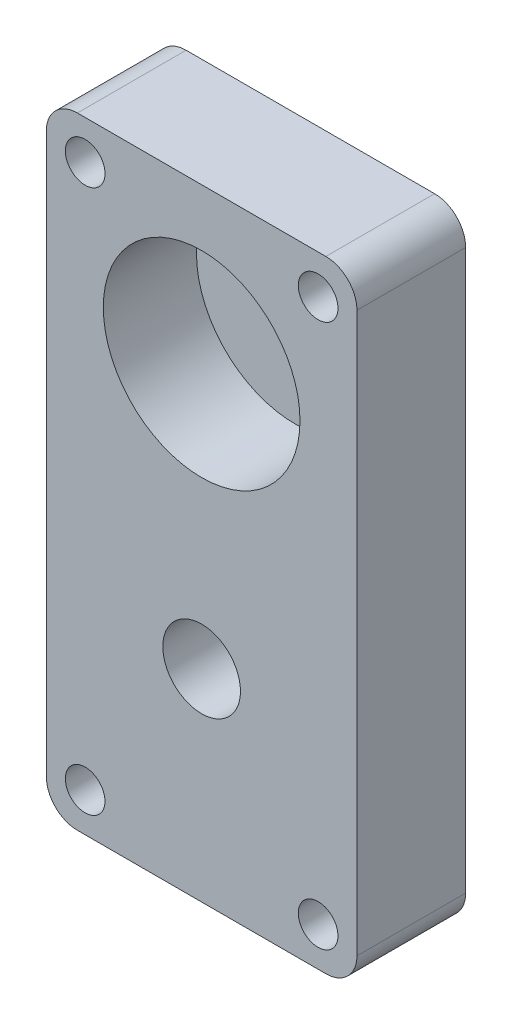
ISO-10303-21;
HEADER;
FILE_DESCRIPTION(('STEP AP214'),'2;1');
FILE_NAME('part.step','',(''),(''),'','','');
FILE_SCHEMA(('AUTOMOTIVE_DESIGN { 1 0 10303 214 1 1 1 1 }'));
ENDSEC;
DATA;
#1=APPLICATION_CONTEXT('core data for automotive mechanical design processes');
#2=APPLICATION_PROTOCOL_DEFINITION('international standard','automotive_design',2000,#1);
#3=PRODUCT_CONTEXT('',#1,'mechanical');
#4=PRODUCT('Part','Part','',(#3));
#5=PRODUCT_RELATED_PRODUCT_CATEGORY('part','',(#4));
#6=PRODUCT_DEFINITION_FORMATION('','',#4);
#7=PRODUCT_DEFINITION_CONTEXT('part definition',#1,'design');
#8=PRODUCT_DEFINITION('design','',#6,#7);
#9=PRODUCT_DEFINITION_SHAPE('','',#8);
#10=(LENGTH_UNIT() NAMED_UNIT(*) SI_UNIT(.MILLI.,.METRE.));
#11=(NAMED_UNIT(*) PLANE_ANGLE_UNIT() SI_UNIT($,.RADIAN.));
#12=(NAMED_UNIT(*) SI_UNIT($,.STERADIAN.) SOLID_ANGLE_UNIT());
#13=UNCERTAINTY_MEASURE_WITH_UNIT(LENGTH_MEASURE(1.E-05),#10,'distance_accuracy_value','');
#14=(GEOMETRIC_REPRESENTATION_CONTEXT(3) GLOBAL_UNCERTAINTY_ASSIGNED_CONTEXT((#13)) GLOBAL_UNIT_ASSIGNED_CONTEXT((#10,
#11,#12)) REPRESENTATION_CONTEXT('',''));
#15=CARTESIAN_POINT('',(0.,0.,0.));
#16=DIRECTION('',(0.,0.,1.));
#17=DIRECTION('',(1.,0.,0.));
#18=AXIS2_PLACEMENT_3D('',#15,#16,#17);
#19=CARTESIAN_POINT('',(0.,-34.,14.));
#20=DIRECTION('',(0.,0.,-1.));
#21=DIRECTION('',(-1.,0.,0.));
#22=AXIS2_PLACEMENT_3D('',#19,#20,#21);
#23=CYLINDRICAL_SURFACE('',#22,5.);
#24=CARTESIAN_POINT('',(0.,-34.,14.));
#25=DIRECTION('',(0.,0.,1.));
#26=DIRECTION('',(1.,0.,0.));
#27=AXIS2_PLACEMENT_3D('',#24,#25,#26);
#28=CIRCLE('',#27,5.);
#29=CARTESIAN_POINT('',(5.,-34.,14.));
#30=VERTEX_POINT('',#29);
#31=EDGE_CURVE('E208',#30,#30,#28,.T.);
#32=ORIENTED_EDGE('',*,*,#31,.T.);
#33=EDGE_LOOP('',(#32));
#34=FACE_BOUND('',#33,.T.);
#35=CARTESIAN_POINT('',(0.,-34.,2.));
#36=DIRECTION('',(0.,0.,-1.));
#37=DIRECTION('',(-1.,0.,0.));
#38=AXIS2_PLACEMENT_3D('',#35,#36,#37);
#39=CIRCLE('',#38,5.);
#40=CARTESIAN_POINT('',(-5.,-34.,2.));
#41=VERTEX_POINT('',#40);
#42=EDGE_CURVE('E39',#41,#41,#39,.T.);
#43=ORIENTED_EDGE('',*,*,#42,.T.);
#44=EDGE_LOOP('',(#43));
#45=FACE_BOUND('',#44,.T.);
#46=ADVANCED_FACE('F35',(#34,#45),#23,.F.);
#47=CARTESIAN_POINT('',(0.,0.,14.));
#48=DIRECTION('',(0.,0.,-1.));
#49=DIRECTION('',(-1.,0.,0.));
#50=AXIS2_PLACEMENT_3D('',#47,#48,#49);
#51=CYLINDRICAL_SURFACE('',#50,12.665);
#52=CARTESIAN_POINT('',(0.,0.,14.));
#53=DIRECTION('',(0.,0.,1.));
#54=DIRECTION('',(1.,0.,0.));
#55=AXIS2_PLACEMENT_3D('',#52,#53,#54);
#56=CIRCLE('',#55,12.665);
#57=CARTESIAN_POINT('',(12.665,0.,14.));
#58=VERTEX_POINT('',#57);
#59=EDGE_CURVE('E188',#58,#58,#56,.T.);
#60=ORIENTED_EDGE('',*,*,#59,.T.);
#61=EDGE_LOOP('',(#60));
#62=FACE_BOUND('',#61,.T.);
#63=CARTESIAN_POINT('',(0.,0.,2.));
#64=DIRECTION('',(0.,0.,-1.));
#65=DIRECTION('',(-1.,0.,0.));
#66=AXIS2_PLACEMENT_3D('',#63,#64,#65);
#67=CIRCLE('',#66,12.665);
#68=CARTESIAN_POINT('',(-12.665,0.,2.));
#69=VERTEX_POINT('',#68);
#70=EDGE_CURVE('E213',#69,#69,#67,.T.);
#71=ORIENTED_EDGE('',*,*,#70,.T.);
#72=EDGE_LOOP('',(#71));
#73=FACE_BOUND('',#72,.T.);
#74=ADVANCED_FACE('F231',(#62,#73),#51,.F.);
#75=CARTESIAN_POINT('',(0.,0.,14.));
#76=DIRECTION('',(0.,0.,1.));
#77=DIRECTION('',(1.,0.,0.));
#78=AXIS2_PLACEMENT_3D('',#75,#76,#77);
#79=PLANE('',#78);
#80=CARTESIAN_POINT('',(15.,-55.,14.));
#81=DIRECTION('',(0.,0.,1.));
#82=DIRECTION('',(-1.,0.,0.));
#83=AXIS2_PLACEMENT_3D('',#80,#81,#82);
#84=CIRCLE('',#83,2.55459899986939);
#85=CARTESIAN_POINT('',(12.4454010001306,-55.,14.));
#86=VERTEX_POINT('',#85);
#87=EDGE_CURVE('E202',#86,#86,#84,.T.);
#88=ORIENTED_EDGE('',*,*,#87,.F.);
#89=EDGE_LOOP('',(#88));
#90=FACE_BOUND('',#89,.T.);
#91=CARTESIAN_POINT('',(-15.,-55.,14.));
#92=DIRECTION('',(0.,0.,1.));
#93=DIRECTION('',(-1.,0.,0.));
#94=AXIS2_PLACEMENT_3D('',#91,#92,#93);
#95=CIRCLE('',#94,2.55459899986931);
#96=CARTESIAN_POINT('',(-17.5545989998693,-55.,14.));
#97=VERTEX_POINT('',#96);
#98=EDGE_CURVE('E192',#97,#97,#95,.T.);
#99=ORIENTED_EDGE('',*,*,#98,.F.);
#100=EDGE_LOOP('',(#99));
#101=FACE_BOUND('',#100,.T.);
#102=CARTESIAN_POINT('',(-15.,15.,14.));
#103=DIRECTION('',(0.,0.,1.));
#104=DIRECTION('',(1.,0.,0.));
#105=AXIS2_PLACEMENT_3D('',#102,#103,#104);
#106=CIRCLE('',#105,2.55459899986932);
#107=CARTESIAN_POINT('',(-12.4454010001307,15.,14.));
#108=VERTEX_POINT('',#107);
#109=EDGE_CURVE('E179',#108,#108,#106,.T.);
#110=ORIENTED_EDGE('',*,*,#109,.F.);
#111=EDGE_LOOP('',(#110));
#112=FACE_BOUND('',#111,.T.);
#113=DIRECTION('',(1.,0.,0.));
#114=VECTOR('',#113,1.);
#115=CARTESIAN_POINT('',(-20.,-60.,14.));
#116=LINE('',#115,#114);
#117=CARTESIAN_POINT('',(-16.,-60.,14.));
#118=VERTEX_POINT('',#117);
#119=CARTESIAN_POINT('',(16.,-60.,14.));
#120=VERTEX_POINT('',#119);
#121=EDGE_CURVE('E173',#118,#120,#116,.T.);
#122=ORIENTED_EDGE('',*,*,#121,.T.);
#123=CARTESIAN_POINT('',(16.,-56.,14.));
#124=DIRECTION('',(0.,0.,1.));
#125=DIRECTION('',(1.,0.,0.));
#126=AXIS2_PLACEMENT_3D('',#123,#124,#125);
#127=CIRCLE('',#126,4.);
#128=CARTESIAN_POINT('',(20.,-56.,14.));
#129=VERTEX_POINT('',#128);
#130=EDGE_CURVE('E151',#120,#129,#127,.T.);
#131=ORIENTED_EDGE('',*,*,#130,.T.);
#132=DIRECTION('',(0.,1.,0.));
#133=VECTOR('',#132,1.);
#134=CARTESIAN_POINT('',(20.,-10.,14.));
#135=LINE('',#134,#133);
#136=CARTESIAN_POINT('',(20.,16.,14.));
#137=VERTEX_POINT('',#136);
#138=EDGE_CURVE('E121',#129,#137,#135,.T.);
#139=ORIENTED_EDGE('',*,*,#138,.T.);
#140=CARTESIAN_POINT('',(16.,16.,14.));
#141=DIRECTION('',(0.,0.,1.));
#142=DIRECTION('',(1.,0.,0.));
#143=AXIS2_PLACEMENT_3D('',#140,#141,#142);
#144=CIRCLE('',#143,4.);
#145=CARTESIAN_POINT('',(16.,20.,14.));
#146=VERTEX_POINT('',#145);
#147=EDGE_CURVE('E57',#137,#146,#144,.T.);
#148=ORIENTED_EDGE('',*,*,#147,.T.);
#149=DIRECTION('',(-1.,0.,0.));
#150=VECTOR('',#149,1.);
#151=CARTESIAN_POINT('',(20.,20.,14.));
#152=LINE('',#151,#150);
#153=CARTESIAN_POINT('',(-16.,20.,14.));
#154=VERTEX_POINT('',#153);
#155=EDGE_CURVE('E138',#146,#154,#152,.T.);
#156=ORIENTED_EDGE('',*,*,#155,.T.);
#157=CARTESIAN_POINT('',(-16.,16.,14.));
#158=DIRECTION('',(0.,0.,1.));
#159=DIRECTION('',(1.,0.,0.));
#160=AXIS2_PLACEMENT_3D('',#157,#158,#159);
#161=CIRCLE('',#160,4.);
#162=CARTESIAN_POINT('',(-20.,16.,14.));
#163=VERTEX_POINT('',#162);
#164=EDGE_CURVE('E146',#154,#163,#161,.T.);
#165=ORIENTED_EDGE('',*,*,#164,.T.);
#166=DIRECTION('',(0.,-1.,0.));
#167=VECTOR('',#166,1.);
#168=CARTESIAN_POINT('',(-20.,-9.99999999999999,14.));
#169=LINE('',#168,#167);
#170=CARTESIAN_POINT('',(-20.,-56.,14.));
#171=VERTEX_POINT('',#170);
#172=EDGE_CURVE('E132',#163,#171,#169,.T.);
#173=ORIENTED_EDGE('',*,*,#172,.T.);
#174=CARTESIAN_POINT('',(-16.,-56.,14.));
#175=DIRECTION('',(0.,0.,1.));
#176=DIRECTION('',(1.,0.,0.));
#177=AXIS2_PLACEMENT_3D('',#174,#175,#176);
#178=CIRCLE('',#177,4.);
#179=EDGE_CURVE('E149',#171,#118,#178,.T.);
#180=ORIENTED_EDGE('',*,*,#179,.T.);
#181=EDGE_LOOP('',(#122,#131,#139,#148,#156,#165,#173,#180));
#182=FACE_BOUND('',#181,.T.);
#183=ORIENTED_EDGE('',*,*,#59,.F.);
#184=EDGE_LOOP('',(#183));
#185=FACE_BOUND('',#184,.T.);
#186=CARTESIAN_POINT('',(15.,15.,14.));
#187=DIRECTION('',(0.,0.,1.));
#188=DIRECTION('',(1.,0.,0.));
#189=AXIS2_PLACEMENT_3D('',#186,#187,#188);
#190=CIRCLE('',#189,2.55459899986937);
#191=CARTESIAN_POINT('',(17.5545989998694,15.,14.));
#192=VERTEX_POINT('',#191);
#193=EDGE_CURVE('E196',#192,#192,#190,.T.);
#194=ORIENTED_EDGE('',*,*,#193,.F.);
#195=EDGE_LOOP('',(#194));
#196=FACE_BOUND('',#195,.T.);
#197=ORIENTED_EDGE('',*,*,#31,.F.);
#198=EDGE_LOOP('',(#197));
#199=FACE_BOUND('',#198,.T.);
#200=ADVANCED_FACE('F169',(#90,#101,#112,#182,#185,#196,#199),#79,.T.);
#201=CARTESIAN_POINT('',(0.,0.,0.));
#202=DIRECTION('',(0.,0.,1.));
#203=DIRECTION('',(1.,0.,0.));
#204=AXIS2_PLACEMENT_3D('',#201,#202,#203);
#205=PLANE('',#204);
#206=DIRECTION('',(0.,1.,0.));
#207=VECTOR('',#206,1.);
#208=CARTESIAN_POINT('',(20.,-10.,0.));
#209=LINE('',#208,#207);
#210=CARTESIAN_POINT('',(20.,-56.,0.));
#211=VERTEX_POINT('',#210);
#212=CARTESIAN_POINT('',(20.,16.,0.));
#213=VERTEX_POINT('',#212);
#214=EDGE_CURVE('E119',#211,#213,#209,.T.);
#215=ORIENTED_EDGE('',*,*,#214,.F.);
#216=CARTESIAN_POINT('',(16.,-56.,0.));
#217=DIRECTION('',(0.,0.,1.));
#218=DIRECTION('',(1.,0.,0.));
#219=AXIS2_PLACEMENT_3D('',#216,#217,#218);
#220=CIRCLE('',#219,4.);
#221=CARTESIAN_POINT('',(16.,-60.,0.));
#222=VERTEX_POINT('',#221);
#223=EDGE_CURVE('E102',#211,#222,#220,.F.);
#224=ORIENTED_EDGE('',*,*,#223,.T.);
#225=DIRECTION('',(1.,0.,0.));
#226=VECTOR('',#225,1.);
#227=CARTESIAN_POINT('',(-20.,-60.,0.));
#228=LINE('',#227,#226);
#229=CARTESIAN_POINT('',(-16.,-60.,0.));
#230=VERTEX_POINT('',#229);
#231=EDGE_CURVE('E130',#230,#222,#228,.T.);
#232=ORIENTED_EDGE('',*,*,#231,.F.);
#233=CARTESIAN_POINT('',(-16.,-56.,0.));
#234=DIRECTION('',(0.,0.,1.));
#235=DIRECTION('',(1.,0.,0.));
#236=AXIS2_PLACEMENT_3D('',#233,#234,#235);
#237=CIRCLE('',#236,4.);
#238=CARTESIAN_POINT('',(-20.,-56.,0.));
#239=VERTEX_POINT('',#238);
#240=EDGE_CURVE('E113',#230,#239,#237,.F.);
#241=ORIENTED_EDGE('',*,*,#240,.T.);
#242=DIRECTION('',(0.,-1.,0.));
#243=VECTOR('',#242,1.);
#244=CARTESIAN_POINT('',(-20.,-9.99999999999999,0.));
#245=LINE('',#244,#243);
#246=CARTESIAN_POINT('',(-20.,16.,0.));
#247=VERTEX_POINT('',#246);
#248=EDGE_CURVE('E134',#247,#239,#245,.T.);
#249=ORIENTED_EDGE('',*,*,#248,.F.);
#250=CARTESIAN_POINT('',(-16.,16.,0.));
#251=DIRECTION('',(0.,0.,1.));
#252=DIRECTION('',(1.,0.,0.));
#253=AXIS2_PLACEMENT_3D('',#250,#251,#252);
#254=CIRCLE('',#253,4.);
#255=CARTESIAN_POINT('',(-16.,20.,0.));
#256=VERTEX_POINT('',#255);
#257=EDGE_CURVE('E122',#247,#256,#254,.F.);
#258=ORIENTED_EDGE('',*,*,#257,.T.);
#259=DIRECTION('',(-1.,0.,0.));
#260=VECTOR('',#259,1.);
#261=CARTESIAN_POINT('',(20.,20.,0.));
#262=LINE('',#261,#260);
#263=CARTESIAN_POINT('',(16.,20.,0.));
#264=VERTEX_POINT('',#263);
#265=EDGE_CURVE('E129',#264,#256,#262,.T.);
#266=ORIENTED_EDGE('',*,*,#265,.F.);
#267=CARTESIAN_POINT('',(16.,16.,0.));
#268=DIRECTION('',(0.,0.,1.));
#269=DIRECTION('',(1.,0.,0.));
#270=AXIS2_PLACEMENT_3D('',#267,#268,#269);
#271=CIRCLE('',#270,4.);
#272=EDGE_CURVE('E128',#264,#213,#271,.F.);
#273=ORIENTED_EDGE('',*,*,#272,.T.);
#274=EDGE_LOOP('',(#215,#224,#232,#241,#249,#258,#266,#273));
#275=FACE_BOUND('',#274,.T.);
#276=CARTESIAN_POINT('',(-15.,15.,0.));
#277=DIRECTION('',(0.,0.,1.));
#278=DIRECTION('',(1.,0.,0.));
#279=AXIS2_PLACEMENT_3D('',#276,#277,#278);
#280=CIRCLE('',#279,2.55459899986932);
#281=CARTESIAN_POINT('',(-12.4454010001307,15.,0.));
#282=VERTEX_POINT('',#281);
#283=EDGE_CURVE('E181',#282,#282,#280,.T.);
#284=ORIENTED_EDGE('',*,*,#283,.T.);
#285=EDGE_LOOP('',(#284));
#286=FACE_BOUND('',#285,.T.);
#287=CARTESIAN_POINT('',(-15.,-55.,0.));
#288=DIRECTION('',(0.,0.,1.));
#289=DIRECTION('',(-1.,0.,0.));
#290=AXIS2_PLACEMENT_3D('',#287,#288,#289);
#291=CIRCLE('',#290,2.55459899986931);
#292=CARTESIAN_POINT('',(-17.5545989998693,-55.,0.));
#293=VERTEX_POINT('',#292);
#294=EDGE_CURVE('E193',#293,#293,#291,.T.);
#295=ORIENTED_EDGE('',*,*,#294,.T.);
#296=EDGE_LOOP('',(#295));
#297=FACE_BOUND('',#296,.T.);
#298=CARTESIAN_POINT('',(15.,15.,0.));
#299=DIRECTION('',(0.,0.,1.));
#300=DIRECTION('',(1.,0.,0.));
#301=AXIS2_PLACEMENT_3D('',#298,#299,#300);
#302=CIRCLE('',#301,2.55459899986937);
#303=CARTESIAN_POINT('',(17.5545989998694,15.,0.));
#304=VERTEX_POINT('',#303);
#305=EDGE_CURVE('E199',#304,#304,#302,.T.);
#306=ORIENTED_EDGE('',*,*,#305,.T.);
#307=EDGE_LOOP('',(#306));
#308=FACE_BOUND('',#307,.T.);
#309=CARTESIAN_POINT('',(15.,-55.,0.));
#310=DIRECTION('',(0.,0.,1.));
#311=DIRECTION('',(-1.,0.,0.));
#312=AXIS2_PLACEMENT_3D('',#309,#310,#311);
#313=CIRCLE('',#312,2.55459899986939);
#314=CARTESIAN_POINT('',(12.4454010001306,-55.,0.));
#315=VERTEX_POINT('',#314);
#316=EDGE_CURVE('E205',#315,#315,#313,.T.);
#317=ORIENTED_EDGE('',*,*,#316,.T.);
#318=EDGE_LOOP('',(#317));
#319=FACE_BOUND('',#318,.T.);
#320=ADVANCED_FACE('F125',(#275,#286,#297,#308,#319),#205,.F.);
#321=CARTESIAN_POINT('',(-20.,-9.99999999999999,14.));
#322=DIRECTION('',(1.,0.,0.));
#323=DIRECTION('',(0.,1.,0.));
#324=AXIS2_PLACEMENT_3D('',#321,#322,#323);
#325=PLANE('',#324);
#326=ORIENTED_EDGE('',*,*,#248,.T.);
#327=DIRECTION('',(0.,0.,-1.));
#328=VECTOR('',#327,1.);
#329=CARTESIAN_POINT('',(-20.,-56.,14.));
#330=LINE('',#329,#328);
#331=EDGE_CURVE('E156',#239,#171,#330,.F.);
#332=ORIENTED_EDGE('',*,*,#331,.T.);
#333=ORIENTED_EDGE('',*,*,#172,.F.);
#334=DIRECTION('',(0.,0.,-1.));
#335=VECTOR('',#334,1.);
#336=CARTESIAN_POINT('',(-20.,16.,14.));
#337=LINE('',#336,#335);
#338=EDGE_CURVE('E153',#163,#247,#337,.T.);
#339=ORIENTED_EDGE('',*,*,#338,.T.);
#340=EDGE_LOOP('',(#326,#332,#333,#339));
#341=FACE_BOUND('',#340,.T.);
#342=ADVANCED_FACE('F163',(#341),#325,.F.);
#343=CARTESIAN_POINT('',(-20.,-60.,14.));
#344=DIRECTION('',(0.,1.,0.));
#345=DIRECTION('',(0.,0.,1.));
#346=AXIS2_PLACEMENT_3D('',#343,#344,#345);
#347=PLANE('',#346);
#348=ORIENTED_EDGE('',*,*,#231,.T.);
#349=DIRECTION('',(0.,0.,-1.));
#350=VECTOR('',#349,1.);
#351=CARTESIAN_POINT('',(16.,-60.,14.));
#352=LINE('',#351,#350);
#353=EDGE_CURVE('E107',#222,#120,#352,.F.);
#354=ORIENTED_EDGE('',*,*,#353,.T.);
#355=ORIENTED_EDGE('',*,*,#121,.F.);
#356=DIRECTION('',(0.,0.,-1.));
#357=VECTOR('',#356,1.);
#358=CARTESIAN_POINT('',(-16.,-60.,14.));
#359=LINE('',#358,#357);
#360=EDGE_CURVE('E112',#118,#230,#359,.T.);
#361=ORIENTED_EDGE('',*,*,#360,.T.);
#362=EDGE_LOOP('',(#348,#354,#355,#361));
#363=FACE_BOUND('',#362,.T.);
#364=ADVANCED_FACE('F178',(#363),#347,.F.);
#365=CARTESIAN_POINT('',(20.,-10.,14.));
#366=DIRECTION('',(-1.,0.,0.));
#367=DIRECTION('',(0.,-1.,0.));
#368=AXIS2_PLACEMENT_3D('',#365,#366,#367);
#369=PLANE('',#368);
#370=ORIENTED_EDGE('',*,*,#138,.F.);
#371=DIRECTION('',(0.,0.,-1.));
#372=VECTOR('',#371,1.);
#373=CARTESIAN_POINT('',(20.,-56.,14.));
#374=LINE('',#373,#372);
#375=EDGE_CURVE('E106',#129,#211,#374,.T.);
#376=ORIENTED_EDGE('',*,*,#375,.T.);
#377=ORIENTED_EDGE('',*,*,#214,.T.);
#378=DIRECTION('',(0.,0.,-1.));
#379=VECTOR('',#378,1.);
#380=CARTESIAN_POINT('',(20.,16.,14.));
#381=LINE('',#380,#379);
#382=EDGE_CURVE('E123',#213,#137,#381,.F.);
#383=ORIENTED_EDGE('',*,*,#382,.T.);
#384=EDGE_LOOP('',(#370,#376,#377,#383));
#385=FACE_BOUND('',#384,.T.);
#386=ADVANCED_FACE('F118',(#385),#369,.F.);
#387=CARTESIAN_POINT('',(20.,20.,14.));
#388=DIRECTION('',(0.,-1.,0.));
#389=DIRECTION('',(0.,0.,-1.));
#390=AXIS2_PLACEMENT_3D('',#387,#388,#389);
#391=PLANE('',#390);
#392=ORIENTED_EDGE('',*,*,#155,.F.);
#393=DIRECTION('',(0.,0.,-1.));
#394=VECTOR('',#393,1.);
#395=CARTESIAN_POINT('',(16.,20.,14.));
#396=LINE('',#395,#394);
#397=EDGE_CURVE('E11',#146,#264,#396,.T.);
#398=ORIENTED_EDGE('',*,*,#397,.T.);
#399=ORIENTED_EDGE('',*,*,#265,.T.);
#400=DIRECTION('',(0.,0.,-1.));
#401=VECTOR('',#400,1.);
#402=CARTESIAN_POINT('',(-16.,20.,14.));
#403=LINE('',#402,#401);
#404=EDGE_CURVE('E44',#256,#154,#403,.F.);
#405=ORIENTED_EDGE('',*,*,#404,.T.);
#406=EDGE_LOOP('',(#392,#398,#399,#405));
#407=FACE_BOUND('',#406,.T.);
#408=ADVANCED_FACE('F255',(#407),#391,.F.);
#409=CARTESIAN_POINT('',(-15.,15.,14.));
#410=DIRECTION('',(0.,0.,-1.));
#411=DIRECTION('',(-1.,0.,0.));
#412=AXIS2_PLACEMENT_3D('',#409,#410,#411);
#413=CYLINDRICAL_SURFACE('',#412,2.55459899986932);
#414=ORIENTED_EDGE('',*,*,#109,.T.);
#415=EDGE_LOOP('',(#414));
#416=FACE_BOUND('',#415,.T.);
#417=ORIENTED_EDGE('',*,*,#283,.F.);
#418=EDGE_LOOP('',(#417));
#419=FACE_BOUND('',#418,.T.);
#420=ADVANCED_FACE('F250',(#416,#419),#413,.F.);
#421=CARTESIAN_POINT('',(-15.,-55.,14.));
#422=DIRECTION('',(0.,0.,-1.));
#423=DIRECTION('',(-1.,0.,0.));
#424=AXIS2_PLACEMENT_3D('',#421,#422,#423);
#425=CYLINDRICAL_SURFACE('',#424,2.55459899986931);
#426=ORIENTED_EDGE('',*,*,#98,.T.);
#427=EDGE_LOOP('',(#426));
#428=FACE_BOUND('',#427,.T.);
#429=ORIENTED_EDGE('',*,*,#294,.F.);
#430=EDGE_LOOP('',(#429));
#431=FACE_BOUND('',#430,.T.);
#432=ADVANCED_FACE('F247',(#428,#431),#425,.F.);
#433=CARTESIAN_POINT('',(15.,15.,14.));
#434=DIRECTION('',(0.,0.,-1.));
#435=DIRECTION('',(-1.,0.,0.));
#436=AXIS2_PLACEMENT_3D('',#433,#434,#435);
#437=CYLINDRICAL_SURFACE('',#436,2.55459899986937);
#438=ORIENTED_EDGE('',*,*,#193,.T.);
#439=EDGE_LOOP('',(#438));
#440=FACE_BOUND('',#439,.T.);
#441=ORIENTED_EDGE('',*,*,#305,.F.);
#442=EDGE_LOOP('',(#441));
#443=FACE_BOUND('',#442,.T.);
#444=ADVANCED_FACE('F243',(#440,#443),#437,.F.);
#445=CARTESIAN_POINT('',(15.,-55.,14.));
#446=DIRECTION('',(0.,0.,-1.));
#447=DIRECTION('',(-1.,0.,0.));
#448=AXIS2_PLACEMENT_3D('',#445,#446,#447);
#449=CYLINDRICAL_SURFACE('',#448,2.55459899986939);
#450=ORIENTED_EDGE('',*,*,#87,.T.);
#451=EDGE_LOOP('',(#450));
#452=FACE_BOUND('',#451,.T.);
#453=ORIENTED_EDGE('',*,*,#316,.F.);
#454=EDGE_LOOP('',(#453));
#455=FACE_BOUND('',#454,.T.);
#456=ADVANCED_FACE('F240',(#452,#455),#449,.F.);
#457=CARTESIAN_POINT('',(16.,-56.,14.));
#458=DIRECTION('',(0.,0.,-1.));
#459=DIRECTION('',(-1.,0.,0.));
#460=AXIS2_PLACEMENT_3D('',#457,#458,#459);
#461=CYLINDRICAL_SURFACE('',#460,4.);
#462=ORIENTED_EDGE('',*,*,#130,.F.);
#463=ORIENTED_EDGE('',*,*,#353,.F.);
#464=ORIENTED_EDGE('',*,*,#223,.F.);
#465=ORIENTED_EDGE('',*,*,#375,.F.);
#466=EDGE_LOOP('',(#462,#463,#464,#465));
#467=FACE_BOUND('',#466,.T.);
#468=ADVANCED_FACE('F105',(#467),#461,.T.);
#469=CARTESIAN_POINT('',(-16.,-56.,14.));
#470=DIRECTION('',(0.,0.,-1.));
#471=DIRECTION('',(-1.,0.,0.));
#472=AXIS2_PLACEMENT_3D('',#469,#470,#471);
#473=CYLINDRICAL_SURFACE('',#472,4.);
#474=ORIENTED_EDGE('',*,*,#179,.F.);
#475=ORIENTED_EDGE('',*,*,#331,.F.);
#476=ORIENTED_EDGE('',*,*,#240,.F.);
#477=ORIENTED_EDGE('',*,*,#360,.F.);
#478=EDGE_LOOP('',(#474,#475,#476,#477));
#479=FACE_BOUND('',#478,.T.);
#480=ADVANCED_FACE('F176',(#479),#473,.T.);
#481=CARTESIAN_POINT('',(16.,16.,14.));
#482=DIRECTION('',(0.,0.,-1.));
#483=DIRECTION('',(-1.,0.,0.));
#484=AXIS2_PLACEMENT_3D('',#481,#482,#483);
#485=CYLINDRICAL_SURFACE('',#484,4.);
#486=ORIENTED_EDGE('',*,*,#147,.F.);
#487=ORIENTED_EDGE('',*,*,#382,.F.);
#488=ORIENTED_EDGE('',*,*,#272,.F.);
#489=ORIENTED_EDGE('',*,*,#397,.F.);
#490=EDGE_LOOP('',(#486,#487,#488,#489));
#491=FACE_BOUND('',#490,.T.);
#492=ADVANCED_FACE('F273',(#491),#485,.T.);
#493=CARTESIAN_POINT('',(-16.,16.,14.));
#494=DIRECTION('',(0.,0.,-1.));
#495=DIRECTION('',(-1.,0.,0.));
#496=AXIS2_PLACEMENT_3D('',#493,#494,#495);
#497=CYLINDRICAL_SURFACE('',#496,4.);
#498=ORIENTED_EDGE('',*,*,#164,.F.);
#499=ORIENTED_EDGE('',*,*,#404,.F.);
#500=ORIENTED_EDGE('',*,*,#257,.F.);
#501=ORIENTED_EDGE('',*,*,#338,.F.);
#502=EDGE_LOOP('',(#498,#499,#500,#501));
#503=FACE_BOUND('',#502,.T.);
#504=ADVANCED_FACE('F37',(#503),#497,.T.);
#505=CARTESIAN_POINT('',(0.,0.,2.));
#506=DIRECTION('',(0.,0.,-1.));
#507=DIRECTION('',(-1.,0.,0.));
#508=AXIS2_PLACEMENT_3D('',#505,#506,#507);
#509=PLANE('',#508);
#510=ORIENTED_EDGE('',*,*,#70,.F.);
#511=EDGE_LOOP('',(#510));
#512=FACE_BOUND('',#511,.T.);
#513=ADVANCED_FACE('F223',(#512),#509,.F.);
#514=CARTESIAN_POINT('',(0.,-34.,2.));
#515=DIRECTION('',(0.,0.,-1.));
#516=DIRECTION('',(-1.,0.,0.));
#517=AXIS2_PLACEMENT_3D('',#514,#515,#516);
#518=PLANE('',#517);
#519=ORIENTED_EDGE('',*,*,#42,.F.);
#520=EDGE_LOOP('',(#519));
#521=FACE_BOUND('',#520,.T.);
#522=ADVANCED_FACE('F221',(#521),#518,.F.);
#523=CLOSED_SHELL('',(#46,#74,#200,#320,#342,#364,#386,#408,#420,#432,#444,#456,#468,#480,#492,
#504,#513,#522));
#524=MANIFOLD_SOLID_BREP('B2',#523);
#525=ADVANCED_BREP_SHAPE_REPRESENTATION('',(#18,#524),#14);
#526=SHAPE_DEFINITION_REPRESENTATION(#9,#525);
ENDSEC;
END-ISO-10303-21;
